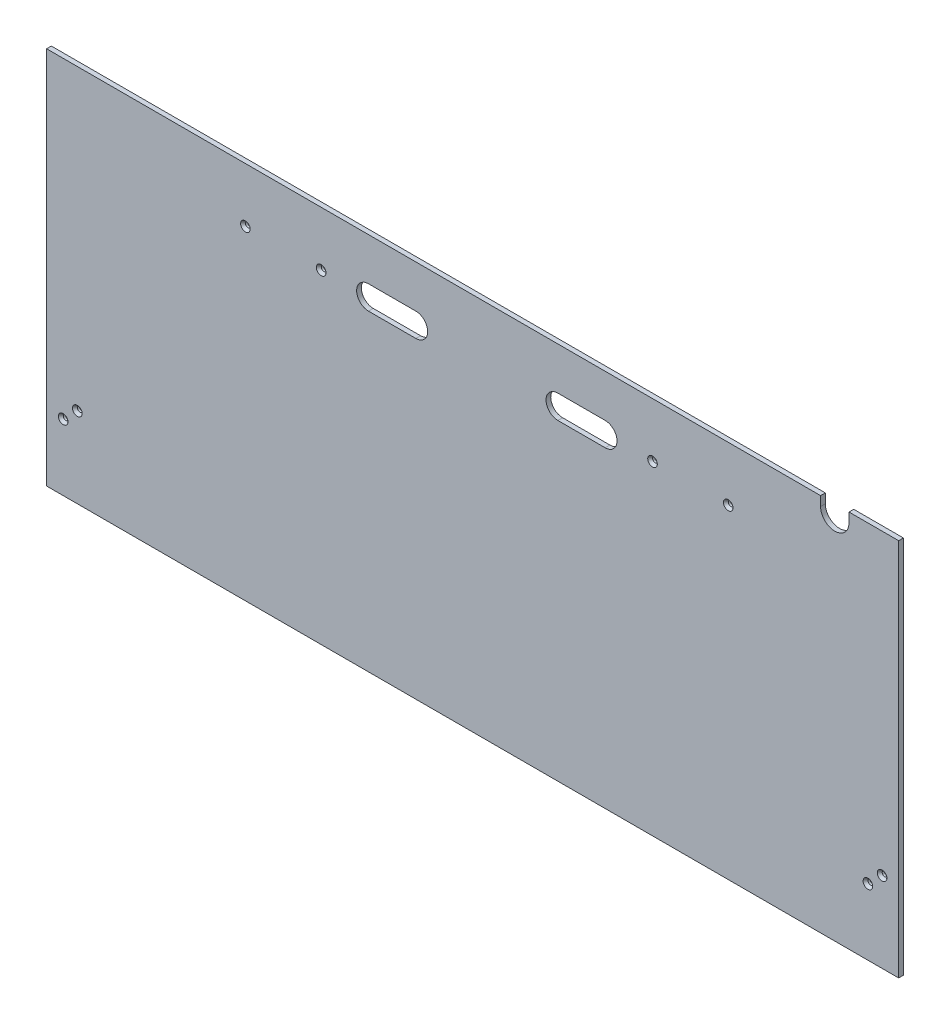
ISO-10303-21;
HEADER;
FILE_DESCRIPTION(('STEP AP214'),'2;1');
FILE_NAME('part.step','',(''),(''),'','','');
FILE_SCHEMA(('AUTOMOTIVE_DESIGN { 1 0 10303 214 1 1 1 1 }'));
ENDSEC;
DATA;
#1=APPLICATION_CONTEXT('core data for automotive mechanical design processes');
#2=APPLICATION_PROTOCOL_DEFINITION('international standard','automotive_design',2000,#1);
#3=PRODUCT_CONTEXT('',#1,'mechanical');
#4=PRODUCT('Part','Part','',(#3));
#5=PRODUCT_RELATED_PRODUCT_CATEGORY('part','',(#4));
#6=PRODUCT_DEFINITION_FORMATION('','',#4);
#7=PRODUCT_DEFINITION_CONTEXT('part definition',#1,'design');
#8=PRODUCT_DEFINITION('design','',#6,#7);
#9=PRODUCT_DEFINITION_SHAPE('','',#8);
#10=(LENGTH_UNIT() NAMED_UNIT(*) SI_UNIT(.MILLI.,.METRE.));
#11=(NAMED_UNIT(*) PLANE_ANGLE_UNIT() SI_UNIT($,.RADIAN.));
#12=(NAMED_UNIT(*) SI_UNIT($,.STERADIAN.) SOLID_ANGLE_UNIT());
#13=UNCERTAINTY_MEASURE_WITH_UNIT(LENGTH_MEASURE(1.E-05),#10,'distance_accuracy_value','');
#14=(GEOMETRIC_REPRESENTATION_CONTEXT(3) GLOBAL_UNCERTAINTY_ASSIGNED_CONTEXT((#13)) GLOBAL_UNIT_ASSIGNED_CONTEXT((#10,
#11,#12)) REPRESENTATION_CONTEXT('',''));
#15=CARTESIAN_POINT('',(0.,0.,0.));
#16=DIRECTION('',(0.,0.,1.));
#17=DIRECTION('',(1.,0.,0.));
#18=AXIS2_PLACEMENT_3D('',#15,#16,#17);
#19=CARTESIAN_POINT('',(0.,508.,6.35));
#20=DIRECTION('',(0.,-1.,0.));
#21=DIRECTION('',(0.,0.,-1.));
#22=AXIS2_PLACEMENT_3D('',#19,#20,#21);
#23=PLANE('',#22);
#24=DIRECTION('',(-1.,0.,0.));
#25=VECTOR('',#24,1.);
#26=CARTESIAN_POINT('',(0.,508.,6.35));
#27=LINE('',#26,#25);
#28=CARTESIAN_POINT('',(1038.225,508.,6.35));
#29=VERTEX_POINT('',#28);
#30=CARTESIAN_POINT('',(0.,508.,6.35));
#31=VERTEX_POINT('',#30);
#32=EDGE_CURVE('E324',#29,#31,#27,.T.);
#33=ORIENTED_EDGE('',*,*,#32,.F.);
#34=DIRECTION('',(0.,0.,1.));
#35=VECTOR('',#34,1.);
#36=CARTESIAN_POINT('',(1038.225,508.,0.));
#37=LINE('',#36,#35);
#38=CARTESIAN_POINT('',(1038.225,508.,0.));
#39=VERTEX_POINT('',#38);
#40=EDGE_CURVE('E175',#39,#29,#37,.T.);
#41=ORIENTED_EDGE('',*,*,#40,.F.);
#42=DIRECTION('',(-1.,0.,0.));
#43=VECTOR('',#42,1.);
#44=CARTESIAN_POINT('',(0.,508.,0.));
#45=LINE('',#44,#43);
#46=CARTESIAN_POINT('',(0.,508.,0.));
#47=VERTEX_POINT('',#46);
#48=EDGE_CURVE('E166',#39,#47,#45,.T.);
#49=ORIENTED_EDGE('',*,*,#48,.T.);
#50=DIRECTION('',(0.,0.,-1.));
#51=VECTOR('',#50,1.);
#52=CARTESIAN_POINT('',(0.,508.,6.35));
#53=LINE('',#52,#51);
#54=EDGE_CURVE('E328',#31,#47,#53,.T.);
#55=ORIENTED_EDGE('',*,*,#54,.F.);
#56=EDGE_LOOP('',(#33,#41,#49,#55));
#57=FACE_BOUND('',#56,.T.);
#58=ADVANCED_FACE('F32',(#57),#23,.F.);
#59=CARTESIAN_POINT('',(0.,0.,6.35));
#60=DIRECTION('',(0.,0.,-1.));
#61=DIRECTION('',(-1.,0.,0.));
#62=AXIS2_PLACEMENT_3D('',#59,#60,#61);
#63=PLANE('',#62);
#64=CARTESIAN_POINT('',(368.3,434.975,6.35));
#65=DIRECTION('',(0.,0.,1.));
#66=DIRECTION('',(1.,0.,0.));
#67=AXIS2_PLACEMENT_3D('',#64,#65,#66);
#68=CIRCLE('',#67,6.43890000000003);
#69=CARTESIAN_POINT('',(374.7389,434.975,6.35));
#70=VERTEX_POINT('',#69);
#71=EDGE_CURVE('E199',#70,#70,#68,.T.);
#72=ORIENTED_EDGE('',*,*,#71,.F.);
#73=EDGE_LOOP('',(#72));
#74=FACE_BOUND('',#73,.T.);
#75=DIRECTION('',(1.,0.,0.));
#76=VECTOR('',#75,1.);
#77=CARTESIAN_POINT('',(431.8,419.1,6.35));
#78=LINE('',#77,#76);
#79=CARTESIAN_POINT('',(431.8,419.1,6.35));
#80=VERTEX_POINT('',#79);
#81=CARTESIAN_POINT('',(495.3,419.1,6.35));
#82=VERTEX_POINT('',#81);
#83=EDGE_CURVE('E269',#80,#82,#78,.T.);
#84=ORIENTED_EDGE('',*,*,#83,.F.);
#85=CARTESIAN_POINT('',(431.8,434.975,6.35));
#86=DIRECTION('',(0.,0.,1.));
#87=DIRECTION('',(1.,0.,0.));
#88=AXIS2_PLACEMENT_3D('',#85,#86,#87);
#89=CIRCLE('',#88,15.875);
#90=CARTESIAN_POINT('',(431.8,450.85,6.35));
#91=VERTEX_POINT('',#90);
#92=EDGE_CURVE('E55',#91,#80,#89,.T.);
#93=ORIENTED_EDGE('',*,*,#92,.F.);
#94=DIRECTION('',(-1.,0.,0.));
#95=VECTOR('',#94,1.);
#96=CARTESIAN_POINT('',(431.8,450.85,6.35));
#97=LINE('',#96,#95);
#98=CARTESIAN_POINT('',(495.3,450.85,6.35));
#99=VERTEX_POINT('',#98);
#100=EDGE_CURVE('E258',#99,#91,#97,.T.);
#101=ORIENTED_EDGE('',*,*,#100,.F.);
#102=CARTESIAN_POINT('',(495.3,434.975,6.35));
#103=DIRECTION('',(0.,0.,1.));
#104=DIRECTION('',(1.,0.,0.));
#105=AXIS2_PLACEMENT_3D('',#102,#103,#104);
#106=CIRCLE('',#105,15.875);
#107=EDGE_CURVE('E273',#82,#99,#106,.T.);
#108=ORIENTED_EDGE('',*,*,#107,.F.);
#109=EDGE_LOOP('',(#84,#93,#101,#108));
#110=FACE_BOUND('',#109,.T.);
#111=DIRECTION('',(1.,0.,0.));
#112=VECTOR('',#111,1.);
#113=CARTESIAN_POINT('',(685.8,419.1,6.35));
#114=LINE('',#113,#112);
#115=CARTESIAN_POINT('',(685.8,419.1,6.35));
#116=VERTEX_POINT('',#115);
#117=CARTESIAN_POINT('',(749.3,419.1,6.35));
#118=VERTEX_POINT('',#117);
#119=EDGE_CURVE('E301',#116,#118,#114,.T.);
#120=ORIENTED_EDGE('',*,*,#119,.F.);
#121=CARTESIAN_POINT('',(685.8,434.975,6.35));
#122=DIRECTION('',(0.,0.,1.));
#123=DIRECTION('',(1.,0.,0.));
#124=AXIS2_PLACEMENT_3D('',#121,#122,#123);
#125=CIRCLE('',#124,15.875);
#126=CARTESIAN_POINT('',(685.8,450.85,6.35));
#127=VERTEX_POINT('',#126);
#128=EDGE_CURVE('E253',#127,#116,#125,.T.);
#129=ORIENTED_EDGE('',*,*,#128,.F.);
#130=DIRECTION('',(-1.,0.,0.));
#131=VECTOR('',#130,1.);
#132=CARTESIAN_POINT('',(685.8,450.85,6.35));
#133=LINE('',#132,#131);
#134=CARTESIAN_POINT('',(749.3,450.85,6.35));
#135=VERTEX_POINT('',#134);
#136=EDGE_CURVE('E290',#135,#127,#133,.T.);
#137=ORIENTED_EDGE('',*,*,#136,.F.);
#138=CARTESIAN_POINT('',(749.3,434.975,6.35));
#139=DIRECTION('',(0.,0.,1.));
#140=DIRECTION('',(1.,0.,0.));
#141=AXIS2_PLACEMENT_3D('',#138,#139,#140);
#142=CIRCLE('',#141,15.875);
#143=EDGE_CURVE('E304',#118,#135,#142,.T.);
#144=ORIENTED_EDGE('',*,*,#143,.F.);
#145=EDGE_LOOP('',(#120,#129,#137,#144));
#146=FACE_BOUND('',#145,.T.);
#147=CARTESIAN_POINT('',(1057.275,495.3,6.35));
#148=DIRECTION('',(0.,0.,1.));
#149=DIRECTION('',(-1.,0.,0.));
#150=AXIS2_PLACEMENT_3D('',#147,#148,#149);
#151=CIRCLE('',#150,19.05);
#152=CARTESIAN_POINT('',(1038.225,495.3,6.35));
#153=VERTEX_POINT('',#152);
#154=CARTESIAN_POINT('',(1076.325,495.3,6.35));
#155=VERTEX_POINT('',#154);
#156=EDGE_CURVE('E169',#153,#155,#151,.T.);
#157=ORIENTED_EDGE('',*,*,#156,.F.);
#158=DIRECTION('',(0.,-1.,0.));
#159=VECTOR('',#158,1.);
#160=CARTESIAN_POINT('',(1038.225,508.,6.35));
#161=LINE('',#160,#159);
#162=EDGE_CURVE('E151',#29,#153,#161,.T.);
#163=ORIENTED_EDGE('',*,*,#162,.F.);
#164=ORIENTED_EDGE('',*,*,#32,.T.);
#165=DIRECTION('',(0.,-1.,0.));
#166=VECTOR('',#165,1.);
#167=CARTESIAN_POINT('',(0.,0.,6.35));
#168=LINE('',#167,#166);
#169=CARTESIAN_POINT('',(0.,0.,6.35));
#170=VERTEX_POINT('',#169);
#171=EDGE_CURVE('E316',#31,#170,#168,.T.);
#172=ORIENTED_EDGE('',*,*,#171,.T.);
#173=DIRECTION('',(1.,0.,0.));
#174=VECTOR('',#173,1.);
#175=CARTESIAN_POINT('',(0.,0.,6.35));
#176=LINE('',#175,#174);
#177=CARTESIAN_POINT('',(1143.,0.,6.35));
#178=VERTEX_POINT('',#177);
#179=EDGE_CURVE('E319',#170,#178,#176,.T.);
#180=ORIENTED_EDGE('',*,*,#179,.T.);
#181=DIRECTION('',(0.,1.,0.));
#182=VECTOR('',#181,1.);
#183=CARTESIAN_POINT('',(1143.,0.,6.35));
#184=LINE('',#183,#182);
#185=CARTESIAN_POINT('',(1143.,508.,6.35));
#186=VERTEX_POINT('',#185);
#187=EDGE_CURVE('E322',#178,#186,#184,.T.);
#188=ORIENTED_EDGE('',*,*,#187,.T.);
#189=CARTESIAN_POINT('',(1076.325,508.,6.35));
#190=VERTEX_POINT('',#189);
#191=EDGE_CURVE('E325',#186,#190,#27,.T.);
#192=ORIENTED_EDGE('',*,*,#191,.T.);
#193=DIRECTION('',(0.,1.,0.));
#194=VECTOR('',#193,1.);
#195=CARTESIAN_POINT('',(1076.325,508.,6.35));
#196=LINE('',#195,#194);
#197=EDGE_CURVE('E167',#155,#190,#196,.T.);
#198=ORIENTED_EDGE('',*,*,#197,.F.);
#199=EDGE_LOOP('',(#157,#163,#164,#172,#180,#188,#192,#198));
#200=FACE_BOUND('',#199,.T.);
#201=CARTESIAN_POINT('',(22.2249999999999,88.9,6.35));
#202=DIRECTION('',(0.,0.,1.));
#203=DIRECTION('',(1.,0.,0.));
#204=AXIS2_PLACEMENT_3D('',#201,#202,#203);
#205=CIRCLE('',#204,6.4389);
#206=CARTESIAN_POINT('',(28.6638999999999,88.9,6.35));
#207=VERTEX_POINT('',#206);
#208=EDGE_CURVE('E244',#207,#207,#205,.T.);
#209=ORIENTED_EDGE('',*,*,#208,.F.);
#210=EDGE_LOOP('',(#209));
#211=FACE_BOUND('',#210,.T.);
#212=CARTESIAN_POINT('',(41.2749999999999,107.95,6.35));
#213=DIRECTION('',(0.,0.,1.));
#214=DIRECTION('',(1.,0.,0.));
#215=AXIS2_PLACEMENT_3D('',#212,#213,#214);
#216=CIRCLE('',#215,6.4389);
#217=CARTESIAN_POINT('',(47.7138999999999,107.95,6.35));
#218=VERTEX_POINT('',#217);
#219=EDGE_CURVE('E235',#218,#218,#216,.T.);
#220=ORIENTED_EDGE('',*,*,#219,.F.);
#221=EDGE_LOOP('',(#220));
#222=FACE_BOUND('',#221,.T.);
#223=CARTESIAN_POINT('',(1101.725,88.9,6.35));
#224=DIRECTION('',(0.,0.,1.));
#225=DIRECTION('',(1.,0.,0.));
#226=AXIS2_PLACEMENT_3D('',#223,#224,#225);
#227=CIRCLE('',#226,6.43890000000003);
#228=CARTESIAN_POINT('',(1108.1639,88.9,6.35));
#229=VERTEX_POINT('',#228);
#230=EDGE_CURVE('E226',#229,#229,#227,.T.);
#231=ORIENTED_EDGE('',*,*,#230,.F.);
#232=EDGE_LOOP('',(#231));
#233=FACE_BOUND('',#232,.T.);
#234=CARTESIAN_POINT('',(1120.775,107.95,6.35));
#235=DIRECTION('',(0.,0.,1.));
#236=DIRECTION('',(1.,0.,0.));
#237=AXIS2_PLACEMENT_3D('',#234,#235,#236);
#238=CIRCLE('',#237,6.43890000000003);
#239=CARTESIAN_POINT('',(1127.2139,107.95,6.35));
#240=VERTEX_POINT('',#239);
#241=EDGE_CURVE('E217',#240,#240,#238,.T.);
#242=ORIENTED_EDGE('',*,*,#241,.F.);
#243=EDGE_LOOP('',(#242));
#244=FACE_BOUND('',#243,.T.);
#245=CARTESIAN_POINT('',(266.7,434.975,6.35));
#246=DIRECTION('',(0.,0.,1.));
#247=DIRECTION('',(1.,0.,0.));
#248=AXIS2_PLACEMENT_3D('',#245,#246,#247);
#249=CIRCLE('',#248,6.43890000000003);
#250=CARTESIAN_POINT('',(273.1389,434.975,6.35));
#251=VERTEX_POINT('',#250);
#252=EDGE_CURVE('E208',#251,#251,#249,.T.);
#253=ORIENTED_EDGE('',*,*,#252,.F.);
#254=EDGE_LOOP('',(#253));
#255=FACE_BOUND('',#254,.T.);
#256=CARTESIAN_POINT('',(812.8,434.975,6.35));
#257=DIRECTION('',(0.,0.,1.));
#258=DIRECTION('',(1.,0.,0.));
#259=AXIS2_PLACEMENT_3D('',#256,#257,#258);
#260=CIRCLE('',#259,6.43890000000003);
#261=CARTESIAN_POINT('',(819.2389,434.975,6.35));
#262=VERTEX_POINT('',#261);
#263=EDGE_CURVE('E190',#262,#262,#260,.T.);
#264=ORIENTED_EDGE('',*,*,#263,.F.);
#265=EDGE_LOOP('',(#264));
#266=FACE_BOUND('',#265,.T.);
#267=CARTESIAN_POINT('',(914.4,434.975,6.35));
#268=DIRECTION('',(0.,0.,1.));
#269=DIRECTION('',(1.,0.,0.));
#270=AXIS2_PLACEMENT_3D('',#267,#268,#269);
#271=CIRCLE('',#270,6.43890000000003);
#272=CARTESIAN_POINT('',(920.8389,434.975,6.35));
#273=VERTEX_POINT('',#272);
#274=EDGE_CURVE('E177',#273,#273,#271,.T.);
#275=ORIENTED_EDGE('',*,*,#274,.F.);
#276=EDGE_LOOP('',(#275));
#277=FACE_BOUND('',#276,.T.);
#278=ADVANCED_FACE('F355',(#74,#110,#146,#200,#211,#222,#233,#244,#255,#266,#277),#63,.F.);
#279=CARTESIAN_POINT('',(0.,0.,6.35));
#280=DIRECTION('',(1.,0.,0.));
#281=DIRECTION('',(0.,0.,-1.));
#282=AXIS2_PLACEMENT_3D('',#279,#280,#281);
#283=PLANE('',#282);
#284=DIRECTION('',(0.,-1.,0.));
#285=VECTOR('',#284,1.);
#286=CARTESIAN_POINT('',(0.,0.,0.));
#287=LINE('',#286,#285);
#288=CARTESIAN_POINT('',(0.,0.,0.));
#289=VERTEX_POINT('',#288);
#290=EDGE_CURVE('E280',#47,#289,#287,.T.);
#291=ORIENTED_EDGE('',*,*,#290,.T.);
#292=DIRECTION('',(0.,0.,-1.));
#293=VECTOR('',#292,1.);
#294=CARTESIAN_POINT('',(0.,0.,6.35));
#295=LINE('',#294,#293);
#296=EDGE_CURVE('E11',#170,#289,#295,.T.);
#297=ORIENTED_EDGE('',*,*,#296,.F.);
#298=ORIENTED_EDGE('',*,*,#171,.F.);
#299=ORIENTED_EDGE('',*,*,#54,.T.);
#300=EDGE_LOOP('',(#291,#297,#298,#299));
#301=FACE_BOUND('',#300,.T.);
#302=ADVANCED_FACE('F34',(#301),#283,.F.);
#303=CARTESIAN_POINT('',(0.,0.,6.35));
#304=DIRECTION('',(0.,1.,0.));
#305=DIRECTION('',(0.,0.,1.));
#306=AXIS2_PLACEMENT_3D('',#303,#304,#305);
#307=PLANE('',#306);
#308=DIRECTION('',(1.,0.,0.));
#309=VECTOR('',#308,1.);
#310=CARTESIAN_POINT('',(0.,0.,0.));
#311=LINE('',#310,#309);
#312=CARTESIAN_POINT('',(1143.,0.,0.));
#313=VERTEX_POINT('',#312);
#314=EDGE_CURVE('E331',#289,#313,#311,.T.);
#315=ORIENTED_EDGE('',*,*,#314,.T.);
#316=DIRECTION('',(0.,0.,-1.));
#317=VECTOR('',#316,1.);
#318=CARTESIAN_POINT('',(1143.,0.,6.35));
#319=LINE('',#318,#317);
#320=EDGE_CURVE('E40',#178,#313,#319,.T.);
#321=ORIENTED_EDGE('',*,*,#320,.F.);
#322=ORIENTED_EDGE('',*,*,#179,.F.);
#323=ORIENTED_EDGE('',*,*,#296,.T.);
#324=EDGE_LOOP('',(#315,#321,#322,#323));
#325=FACE_BOUND('',#324,.T.);
#326=ADVANCED_FACE('F359',(#325),#307,.F.);
#327=CARTESIAN_POINT('',(1143.,0.,6.35));
#328=DIRECTION('',(-1.,0.,0.));
#329=DIRECTION('',(0.,0.,1.));
#330=AXIS2_PLACEMENT_3D('',#327,#328,#329);
#331=PLANE('',#330);
#332=DIRECTION('',(0.,1.,0.));
#333=VECTOR('',#332,1.);
#334=CARTESIAN_POINT('',(1143.,0.,0.));
#335=LINE('',#334,#333);
#336=CARTESIAN_POINT('',(1143.,508.,0.));
#337=VERTEX_POINT('',#336);
#338=EDGE_CURVE('E333',#313,#337,#335,.T.);
#339=ORIENTED_EDGE('',*,*,#338,.T.);
#340=DIRECTION('',(0.,0.,-1.));
#341=VECTOR('',#340,1.);
#342=CARTESIAN_POINT('',(1143.,508.,6.35));
#343=LINE('',#342,#341);
#344=EDGE_CURVE('E339',#186,#337,#343,.T.);
#345=ORIENTED_EDGE('',*,*,#344,.F.);
#346=ORIENTED_EDGE('',*,*,#187,.F.);
#347=ORIENTED_EDGE('',*,*,#320,.T.);
#348=EDGE_LOOP('',(#339,#345,#346,#347));
#349=FACE_BOUND('',#348,.T.);
#350=ADVANCED_FACE('F346',(#349),#331,.F.);
#351=CARTESIAN_POINT('',(1076.325,508.,0.));
#352=VERTEX_POINT('',#351);
#353=EDGE_CURVE('E320',#337,#352,#45,.T.);
#354=ORIENTED_EDGE('',*,*,#353,.T.);
#355=DIRECTION('',(0.,0.,1.));
#356=VECTOR('',#355,1.);
#357=CARTESIAN_POINT('',(1076.325,508.,0.));
#358=LINE('',#357,#356);
#359=EDGE_CURVE('E178',#352,#190,#358,.T.);
#360=ORIENTED_EDGE('',*,*,#359,.T.);
#361=ORIENTED_EDGE('',*,*,#191,.F.);
#362=ORIENTED_EDGE('',*,*,#344,.T.);
#363=EDGE_LOOP('',(#354,#360,#361,#362));
#364=FACE_BOUND('',#363,.T.);
#365=ADVANCED_FACE('F351',(#364),#23,.F.);
#366=CARTESIAN_POINT('',(0.,0.,0.));
#367=DIRECTION('',(0.,0.,-1.));
#368=DIRECTION('',(-1.,0.,0.));
#369=AXIS2_PLACEMENT_3D('',#366,#367,#368);
#370=PLANE('',#369);
#371=DIRECTION('',(0.,-1.,0.));
#372=VECTOR('',#371,1.);
#373=CARTESIAN_POINT('',(1038.225,508.,0.));
#374=LINE('',#373,#372);
#375=CARTESIAN_POINT('',(1038.225,495.3,0.));
#376=VERTEX_POINT('',#375);
#377=EDGE_CURVE('E148',#39,#376,#374,.T.);
#378=ORIENTED_EDGE('',*,*,#377,.T.);
#379=CARTESIAN_POINT('',(1057.275,495.3,0.));
#380=DIRECTION('',(0.,0.,1.));
#381=DIRECTION('',(-1.,0.,0.));
#382=AXIS2_PLACEMENT_3D('',#379,#380,#381);
#383=CIRCLE('',#382,19.05);
#384=CARTESIAN_POINT('',(1076.325,495.3,0.));
#385=VERTEX_POINT('',#384);
#386=EDGE_CURVE('E158',#376,#385,#383,.T.);
#387=ORIENTED_EDGE('',*,*,#386,.T.);
#388=DIRECTION('',(0.,1.,0.));
#389=VECTOR('',#388,1.);
#390=CARTESIAN_POINT('',(1076.325,508.,0.));
#391=LINE('',#390,#389);
#392=EDGE_CURVE('E47',#385,#352,#391,.T.);
#393=ORIENTED_EDGE('',*,*,#392,.T.);
#394=ORIENTED_EDGE('',*,*,#353,.F.);
#395=ORIENTED_EDGE('',*,*,#338,.F.);
#396=ORIENTED_EDGE('',*,*,#314,.F.);
#397=ORIENTED_EDGE('',*,*,#290,.F.);
#398=ORIENTED_EDGE('',*,*,#48,.F.);
#399=EDGE_LOOP('',(#378,#387,#393,#394,#395,#396,#397,#398));
#400=FACE_BOUND('',#399,.T.);
#401=CARTESIAN_POINT('',(914.4,434.975,0.));
#402=DIRECTION('',(0.,0.,-1.));
#403=DIRECTION('',(-1.,0.,0.));
#404=AXIS2_PLACEMENT_3D('',#401,#402,#403);
#405=CIRCLE('',#404,3.3782);
#406=CARTESIAN_POINT('',(911.0218,434.975,0.));
#407=VERTEX_POINT('',#406);
#408=EDGE_CURVE('E187',#407,#407,#405,.T.);
#409=ORIENTED_EDGE('',*,*,#408,.F.);
#410=EDGE_LOOP('',(#409));
#411=FACE_BOUND('',#410,.T.);
#412=CARTESIAN_POINT('',(812.8,434.975,0.));
#413=DIRECTION('',(0.,0.,-1.));
#414=DIRECTION('',(-1.,0.,0.));
#415=AXIS2_PLACEMENT_3D('',#412,#413,#414);
#416=CIRCLE('',#415,3.3782);
#417=CARTESIAN_POINT('',(809.4218,434.975,0.));
#418=VERTEX_POINT('',#417);
#419=EDGE_CURVE('E196',#418,#418,#416,.T.);
#420=ORIENTED_EDGE('',*,*,#419,.F.);
#421=EDGE_LOOP('',(#420));
#422=FACE_BOUND('',#421,.T.);
#423=CARTESIAN_POINT('',(368.3,434.975,0.));
#424=DIRECTION('',(0.,0.,-1.));
#425=DIRECTION('',(-1.,0.,0.));
#426=AXIS2_PLACEMENT_3D('',#423,#424,#425);
#427=CIRCLE('',#426,3.3782);
#428=CARTESIAN_POINT('',(364.9218,434.975,0.));
#429=VERTEX_POINT('',#428);
#430=EDGE_CURVE('E205',#429,#429,#427,.T.);
#431=ORIENTED_EDGE('',*,*,#430,.F.);
#432=EDGE_LOOP('',(#431));
#433=FACE_BOUND('',#432,.T.);
#434=CARTESIAN_POINT('',(266.7,434.975,0.));
#435=DIRECTION('',(0.,0.,-1.));
#436=DIRECTION('',(-1.,0.,0.));
#437=AXIS2_PLACEMENT_3D('',#434,#435,#436);
#438=CIRCLE('',#437,3.3782);
#439=CARTESIAN_POINT('',(263.3218,434.975,0.));
#440=VERTEX_POINT('',#439);
#441=EDGE_CURVE('E214',#440,#440,#438,.T.);
#442=ORIENTED_EDGE('',*,*,#441,.F.);
#443=EDGE_LOOP('',(#442));
#444=FACE_BOUND('',#443,.T.);
#445=CARTESIAN_POINT('',(1120.775,107.95,0.));
#446=DIRECTION('',(0.,0.,-1.));
#447=DIRECTION('',(-1.,0.,0.));
#448=AXIS2_PLACEMENT_3D('',#445,#446,#447);
#449=CIRCLE('',#448,3.3782);
#450=CARTESIAN_POINT('',(1117.3968,107.95,0.));
#451=VERTEX_POINT('',#450);
#452=EDGE_CURVE('E223',#451,#451,#449,.T.);
#453=ORIENTED_EDGE('',*,*,#452,.F.);
#454=EDGE_LOOP('',(#453));
#455=FACE_BOUND('',#454,.T.);
#456=CARTESIAN_POINT('',(1101.725,88.9,0.));
#457=DIRECTION('',(0.,0.,-1.));
#458=DIRECTION('',(-1.,0.,0.));
#459=AXIS2_PLACEMENT_3D('',#456,#457,#458);
#460=CIRCLE('',#459,3.3782);
#461=CARTESIAN_POINT('',(1098.3468,88.9,0.));
#462=VERTEX_POINT('',#461);
#463=EDGE_CURVE('E232',#462,#462,#460,.T.);
#464=ORIENTED_EDGE('',*,*,#463,.F.);
#465=EDGE_LOOP('',(#464));
#466=FACE_BOUND('',#465,.T.);
#467=CARTESIAN_POINT('',(41.2749999999999,107.95,0.));
#468=DIRECTION('',(0.,0.,-1.));
#469=DIRECTION('',(-1.,0.,0.));
#470=AXIS2_PLACEMENT_3D('',#467,#468,#469);
#471=CIRCLE('',#470,3.3782);
#472=CARTESIAN_POINT('',(37.8968,107.95,0.));
#473=VERTEX_POINT('',#472);
#474=EDGE_CURVE('E241',#473,#473,#471,.T.);
#475=ORIENTED_EDGE('',*,*,#474,.F.);
#476=EDGE_LOOP('',(#475));
#477=FACE_BOUND('',#476,.T.);
#478=CARTESIAN_POINT('',(22.2249999999999,88.9,0.));
#479=DIRECTION('',(0.,0.,-1.));
#480=DIRECTION('',(-1.,0.,0.));
#481=AXIS2_PLACEMENT_3D('',#478,#479,#480);
#482=CIRCLE('',#481,3.3782);
#483=CARTESIAN_POINT('',(18.8467999999999,88.9,0.));
#484=VERTEX_POINT('',#483);
#485=EDGE_CURVE('E250',#484,#484,#482,.T.);
#486=ORIENTED_EDGE('',*,*,#485,.F.);
#487=EDGE_LOOP('',(#486));
#488=FACE_BOUND('',#487,.T.);
#489=CARTESIAN_POINT('',(431.8,434.975,0.));
#490=DIRECTION('',(0.,0.,1.));
#491=DIRECTION('',(1.,0.,0.));
#492=AXIS2_PLACEMENT_3D('',#489,#490,#491);
#493=CIRCLE('',#492,15.875);
#494=CARTESIAN_POINT('',(431.8,450.85,0.));
#495=VERTEX_POINT('',#494);
#496=CARTESIAN_POINT('',(431.8,419.1,0.));
#497=VERTEX_POINT('',#496);
#498=EDGE_CURVE('E254',#495,#497,#493,.T.);
#499=ORIENTED_EDGE('',*,*,#498,.T.);
#500=DIRECTION('',(1.,0.,0.));
#501=VECTOR('',#500,1.);
#502=CARTESIAN_POINT('',(431.8,419.1,0.));
#503=LINE('',#502,#501);
#504=CARTESIAN_POINT('',(495.3,419.1,0.));
#505=VERTEX_POINT('',#504);
#506=EDGE_CURVE('E257',#497,#505,#503,.T.);
#507=ORIENTED_EDGE('',*,*,#506,.T.);
#508=CARTESIAN_POINT('',(495.3,434.975,0.));
#509=DIRECTION('',(0.,0.,1.));
#510=DIRECTION('',(1.,0.,0.));
#511=AXIS2_PLACEMENT_3D('',#508,#509,#510);
#512=CIRCLE('',#511,15.875);
#513=CARTESIAN_POINT('',(495.3,450.85,0.));
#514=VERTEX_POINT('',#513);
#515=EDGE_CURVE('E261',#505,#514,#512,.T.);
#516=ORIENTED_EDGE('',*,*,#515,.T.);
#517=DIRECTION('',(-1.,0.,0.));
#518=VECTOR('',#517,1.);
#519=CARTESIAN_POINT('',(431.8,450.85,0.));
#520=LINE('',#519,#518);
#521=EDGE_CURVE('E264',#514,#495,#520,.T.);
#522=ORIENTED_EDGE('',*,*,#521,.T.);
#523=EDGE_LOOP('',(#499,#507,#516,#522));
#524=FACE_BOUND('',#523,.T.);
#525=CARTESIAN_POINT('',(685.8,434.975,0.));
#526=DIRECTION('',(0.,0.,1.));
#527=DIRECTION('',(1.,0.,0.));
#528=AXIS2_PLACEMENT_3D('',#525,#526,#527);
#529=CIRCLE('',#528,15.875);
#530=CARTESIAN_POINT('',(685.8,450.85,0.));
#531=VERTEX_POINT('',#530);
#532=CARTESIAN_POINT('',(685.8,419.1,0.));
#533=VERTEX_POINT('',#532);
#534=EDGE_CURVE('E286',#531,#533,#529,.T.);
#535=ORIENTED_EDGE('',*,*,#534,.T.);
#536=DIRECTION('',(1.,0.,0.));
#537=VECTOR('',#536,1.);
#538=CARTESIAN_POINT('',(685.8,419.1,0.));
#539=LINE('',#538,#537);
#540=CARTESIAN_POINT('',(749.3,419.1,0.));
#541=VERTEX_POINT('',#540);
#542=EDGE_CURVE('E289',#533,#541,#539,.T.);
#543=ORIENTED_EDGE('',*,*,#542,.T.);
#544=CARTESIAN_POINT('',(749.3,434.975,0.));
#545=DIRECTION('',(0.,0.,1.));
#546=DIRECTION('',(1.,0.,0.));
#547=AXIS2_PLACEMENT_3D('',#544,#545,#546);
#548=CIRCLE('',#547,15.875);
#549=CARTESIAN_POINT('',(749.3,450.85,0.));
#550=VERTEX_POINT('',#549);
#551=EDGE_CURVE('E293',#541,#550,#548,.T.);
#552=ORIENTED_EDGE('',*,*,#551,.T.);
#553=DIRECTION('',(-1.,0.,0.));
#554=VECTOR('',#553,1.);
#555=CARTESIAN_POINT('',(685.8,450.85,0.));
#556=LINE('',#555,#554);
#557=EDGE_CURVE('E296',#550,#531,#556,.T.);
#558=ORIENTED_EDGE('',*,*,#557,.T.);
#559=EDGE_LOOP('',(#535,#543,#552,#558));
#560=FACE_BOUND('',#559,.T.);
#561=ADVANCED_FACE('F163',(#400,#411,#422,#433,#444,#455,#466,#477,#488,#524,#560),#370,.T.);
#562=CARTESIAN_POINT('',(685.8,434.975,0.));
#563=DIRECTION('',(0.,0.,1.));
#564=DIRECTION('',(1.,0.,0.));
#565=AXIS2_PLACEMENT_3D('',#562,#563,#564);
#566=CYLINDRICAL_SURFACE('',#565,15.875);
#567=ORIENTED_EDGE('',*,*,#128,.T.);
#568=DIRECTION('',(0.,0.,1.));
#569=VECTOR('',#568,1.);
#570=CARTESIAN_POINT('',(685.8,419.1,0.));
#571=LINE('',#570,#569);
#572=EDGE_CURVE('E299',#533,#116,#571,.T.);
#573=ORIENTED_EDGE('',*,*,#572,.F.);
#574=ORIENTED_EDGE('',*,*,#534,.F.);
#575=DIRECTION('',(0.,0.,1.));
#576=VECTOR('',#575,1.);
#577=CARTESIAN_POINT('',(685.8,450.85,0.));
#578=LINE('',#577,#576);
#579=EDGE_CURVE('E270',#531,#127,#578,.T.);
#580=ORIENTED_EDGE('',*,*,#579,.T.);
#581=EDGE_LOOP('',(#567,#573,#574,#580));
#582=FACE_BOUND('',#581,.T.);
#583=ADVANCED_FACE('F378',(#582),#566,.F.);
#584=CARTESIAN_POINT('',(685.8,450.85,0.));
#585=DIRECTION('',(0.,1.,0.));
#586=DIRECTION('',(0.,0.,1.));
#587=AXIS2_PLACEMENT_3D('',#584,#585,#586);
#588=PLANE('',#587);
#589=ORIENTED_EDGE('',*,*,#136,.T.);
#590=ORIENTED_EDGE('',*,*,#579,.F.);
#591=ORIENTED_EDGE('',*,*,#557,.F.);
#592=DIRECTION('',(0.,0.,1.));
#593=VECTOR('',#592,1.);
#594=CARTESIAN_POINT('',(749.3,450.85,0.));
#595=LINE('',#594,#593);
#596=EDGE_CURVE('E310',#550,#135,#595,.T.);
#597=ORIENTED_EDGE('',*,*,#596,.T.);
#598=EDGE_LOOP('',(#589,#590,#591,#597));
#599=FACE_BOUND('',#598,.T.);
#600=ADVANCED_FACE('F519',(#599),#588,.F.);
#601=CARTESIAN_POINT('',(749.3,434.975,0.));
#602=DIRECTION('',(0.,0.,1.));
#603=DIRECTION('',(1.,0.,0.));
#604=AXIS2_PLACEMENT_3D('',#601,#602,#603);
#605=CYLINDRICAL_SURFACE('',#604,15.875);
#606=ORIENTED_EDGE('',*,*,#143,.T.);
#607=ORIENTED_EDGE('',*,*,#596,.F.);
#608=ORIENTED_EDGE('',*,*,#551,.F.);
#609=DIRECTION('',(0.,0.,1.));
#610=VECTOR('',#609,1.);
#611=CARTESIAN_POINT('',(749.3,419.1,0.));
#612=LINE('',#611,#610);
#613=EDGE_CURVE('E312',#541,#118,#612,.T.);
#614=ORIENTED_EDGE('',*,*,#613,.T.);
#615=EDGE_LOOP('',(#606,#607,#608,#614));
#616=FACE_BOUND('',#615,.T.);
#617=ADVANCED_FACE('F522',(#616),#605,.F.);
#618=CARTESIAN_POINT('',(685.8,419.1,0.));
#619=DIRECTION('',(0.,-1.,0.));
#620=DIRECTION('',(0.,0.,-1.));
#621=AXIS2_PLACEMENT_3D('',#618,#619,#620);
#622=PLANE('',#621);
#623=ORIENTED_EDGE('',*,*,#119,.T.);
#624=ORIENTED_EDGE('',*,*,#613,.F.);
#625=ORIENTED_EDGE('',*,*,#542,.F.);
#626=ORIENTED_EDGE('',*,*,#572,.T.);
#627=EDGE_LOOP('',(#623,#624,#625,#626));
#628=FACE_BOUND('',#627,.T.);
#629=ADVANCED_FACE('F518',(#628),#622,.F.);
#630=CARTESIAN_POINT('',(431.8,434.975,0.));
#631=DIRECTION('',(0.,0.,1.));
#632=DIRECTION('',(1.,0.,0.));
#633=AXIS2_PLACEMENT_3D('',#630,#631,#632);
#634=CYLINDRICAL_SURFACE('',#633,15.875);
#635=ORIENTED_EDGE('',*,*,#92,.T.);
#636=DIRECTION('',(0.,0.,1.));
#637=VECTOR('',#636,1.);
#638=CARTESIAN_POINT('',(431.8,419.1,0.));
#639=LINE('',#638,#637);
#640=EDGE_CURVE('E267',#497,#80,#639,.T.);
#641=ORIENTED_EDGE('',*,*,#640,.F.);
#642=ORIENTED_EDGE('',*,*,#498,.F.);
#643=DIRECTION('',(0.,0.,1.));
#644=VECTOR('',#643,1.);
#645=CARTESIAN_POINT('',(431.8,450.85,0.));
#646=LINE('',#645,#644);
#647=EDGE_CURVE('E278',#495,#91,#646,.T.);
#648=ORIENTED_EDGE('',*,*,#647,.T.);
#649=EDGE_LOOP('',(#635,#641,#642,#648));
#650=FACE_BOUND('',#649,.T.);
#651=ADVANCED_FACE('F508',(#650),#634,.F.);
#652=CARTESIAN_POINT('',(431.8,450.85,0.));
#653=DIRECTION('',(0.,1.,0.));
#654=DIRECTION('',(0.,0.,1.));
#655=AXIS2_PLACEMENT_3D('',#652,#653,#654);
#656=PLANE('',#655);
#657=ORIENTED_EDGE('',*,*,#100,.T.);
#658=ORIENTED_EDGE('',*,*,#647,.F.);
#659=ORIENTED_EDGE('',*,*,#521,.F.);
#660=DIRECTION('',(0.,0.,1.));
#661=VECTOR('',#660,1.);
#662=CARTESIAN_POINT('',(495.3,450.85,0.));
#663=LINE('',#662,#661);
#664=EDGE_CURVE('E281',#514,#99,#663,.T.);
#665=ORIENTED_EDGE('',*,*,#664,.T.);
#666=EDGE_LOOP('',(#657,#658,#659,#665));
#667=FACE_BOUND('',#666,.T.);
#668=ADVANCED_FACE('F504',(#667),#656,.F.);
#669=CARTESIAN_POINT('',(495.3,434.975,0.));
#670=DIRECTION('',(0.,0.,1.));
#671=DIRECTION('',(1.,0.,0.));
#672=AXIS2_PLACEMENT_3D('',#669,#670,#671);
#673=CYLINDRICAL_SURFACE('',#672,15.875);
#674=ORIENTED_EDGE('',*,*,#107,.T.);
#675=ORIENTED_EDGE('',*,*,#664,.F.);
#676=ORIENTED_EDGE('',*,*,#515,.F.);
#677=DIRECTION('',(0.,0.,1.));
#678=VECTOR('',#677,1.);
#679=CARTESIAN_POINT('',(495.3,419.1,0.));
#680=LINE('',#679,#678);
#681=EDGE_CURVE('E283',#505,#82,#680,.T.);
#682=ORIENTED_EDGE('',*,*,#681,.T.);
#683=EDGE_LOOP('',(#674,#675,#676,#682));
#684=FACE_BOUND('',#683,.T.);
#685=ADVANCED_FACE('F507',(#684),#673,.F.);
#686=CARTESIAN_POINT('',(431.8,419.1,0.));
#687=DIRECTION('',(0.,-1.,0.));
#688=DIRECTION('',(0.,0.,-1.));
#689=AXIS2_PLACEMENT_3D('',#686,#687,#688);
#690=PLANE('',#689);
#691=ORIENTED_EDGE('',*,*,#83,.T.);
#692=ORIENTED_EDGE('',*,*,#681,.F.);
#693=ORIENTED_EDGE('',*,*,#506,.F.);
#694=ORIENTED_EDGE('',*,*,#640,.T.);
#695=EDGE_LOOP('',(#691,#692,#693,#694));
#696=FACE_BOUND('',#695,.T.);
#697=ADVANCED_FACE('F502',(#696),#690,.F.);
#698=CARTESIAN_POINT('',(22.2249999999999,88.9,6.35));
#699=DIRECTION('',(0.,0.,1.));
#700=DIRECTION('',(1.,0.,0.));
#701=AXIS2_PLACEMENT_3D('',#698,#699,#700);
#702=CYLINDRICAL_SURFACE('',#701,3.3782);
#703=CARTESIAN_POINT('',(22.2249999999999,88.9,2.82906741601866));
#704=DIRECTION('',(0.,0.,1.));
#705=DIRECTION('',(1.,0.,0.));
#706=AXIS2_PLACEMENT_3D('',#703,#704,#705);
#707=CIRCLE('',#706,3.3782);
#708=CARTESIAN_POINT('',(25.6031999999999,88.9,2.82906741601866));
#709=VERTEX_POINT('',#708);
#710=EDGE_CURVE('E247',#709,#709,#707,.T.);
#711=ORIENTED_EDGE('',*,*,#710,.T.);
#712=EDGE_LOOP('',(#711));
#713=FACE_BOUND('',#712,.T.);
#714=ORIENTED_EDGE('',*,*,#485,.T.);
#715=EDGE_LOOP('',(#714));
#716=FACE_BOUND('',#715,.T.);
#717=ADVANCED_FACE('F498',(#713,#716),#702,.F.);
#718=CARTESIAN_POINT('',(22.2249999999999,88.9,6.35));
#719=DIRECTION('',(0.,0.,1.));
#720=DIRECTION('',(1.,0.,0.));
#721=AXIS2_PLACEMENT_3D('',#718,#719,#720);
#722=CONICAL_SURFACE('',#721,6.4389,0.715584993317677);
#723=ORIENTED_EDGE('',*,*,#710,.F.);
#724=EDGE_LOOP('',(#723));
#725=FACE_BOUND('',#724,.T.);
#726=ORIENTED_EDGE('',*,*,#208,.T.);
#727=EDGE_LOOP('',(#726));
#728=FACE_BOUND('',#727,.T.);
#729=ADVANCED_FACE('F494',(#725,#728),#722,.F.);
#730=CARTESIAN_POINT('',(41.2749999999999,107.95,6.35));
#731=DIRECTION('',(0.,0.,1.));
#732=DIRECTION('',(1.,0.,0.));
#733=AXIS2_PLACEMENT_3D('',#730,#731,#732);
#734=CYLINDRICAL_SURFACE('',#733,3.3782);
#735=CARTESIAN_POINT('',(41.2749999999999,107.95,2.82906741601866));
#736=DIRECTION('',(0.,0.,1.));
#737=DIRECTION('',(1.,0.,0.));
#738=AXIS2_PLACEMENT_3D('',#735,#736,#737);
#739=CIRCLE('',#738,3.3782);
#740=CARTESIAN_POINT('',(44.6531999999999,107.95,2.82906741601866));
#741=VERTEX_POINT('',#740);
#742=EDGE_CURVE('E238',#741,#741,#739,.T.);
#743=ORIENTED_EDGE('',*,*,#742,.T.);
#744=EDGE_LOOP('',(#743));
#745=FACE_BOUND('',#744,.T.);
#746=ORIENTED_EDGE('',*,*,#474,.T.);
#747=EDGE_LOOP('',(#746));
#748=FACE_BOUND('',#747,.T.);
#749=ADVANCED_FACE('F490',(#745,#748),#734,.F.);
#750=CARTESIAN_POINT('',(41.2749999999999,107.95,6.35));
#751=DIRECTION('',(0.,0.,1.));
#752=DIRECTION('',(1.,0.,0.));
#753=AXIS2_PLACEMENT_3D('',#750,#751,#752);
#754=CONICAL_SURFACE('',#753,6.4389,0.715584993317676);
#755=ORIENTED_EDGE('',*,*,#742,.F.);
#756=EDGE_LOOP('',(#755));
#757=FACE_BOUND('',#756,.T.);
#758=ORIENTED_EDGE('',*,*,#219,.T.);
#759=EDGE_LOOP('',(#758));
#760=FACE_BOUND('',#759,.T.);
#761=ADVANCED_FACE('F486',(#757,#760),#754,.F.);
#762=CARTESIAN_POINT('',(1101.725,88.9,6.35));
#763=DIRECTION('',(0.,0.,1.));
#764=DIRECTION('',(1.,0.,0.));
#765=AXIS2_PLACEMENT_3D('',#762,#763,#764);
#766=CYLINDRICAL_SURFACE('',#765,3.3782);
#767=CARTESIAN_POINT('',(1101.725,88.9,2.82906741601866));
#768=DIRECTION('',(0.,0.,1.));
#769=DIRECTION('',(1.,0.,0.));
#770=AXIS2_PLACEMENT_3D('',#767,#768,#769);
#771=CIRCLE('',#770,3.3782);
#772=CARTESIAN_POINT('',(1105.1032,88.9,2.82906741601866));
#773=VERTEX_POINT('',#772);
#774=EDGE_CURVE('E229',#773,#773,#771,.T.);
#775=ORIENTED_EDGE('',*,*,#774,.T.);
#776=EDGE_LOOP('',(#775));
#777=FACE_BOUND('',#776,.T.);
#778=ORIENTED_EDGE('',*,*,#463,.T.);
#779=EDGE_LOOP('',(#778));
#780=FACE_BOUND('',#779,.T.);
#781=ADVANCED_FACE('F482',(#777,#780),#766,.F.);
#782=CARTESIAN_POINT('',(1101.725,88.9,6.35));
#783=DIRECTION('',(0.,0.,1.));
#784=DIRECTION('',(1.,0.,0.));
#785=AXIS2_PLACEMENT_3D('',#782,#783,#784);
#786=CONICAL_SURFACE('',#785,6.43890000000003,0.715584993317681);
#787=ORIENTED_EDGE('',*,*,#774,.F.);
#788=EDGE_LOOP('',(#787));
#789=FACE_BOUND('',#788,.T.);
#790=ORIENTED_EDGE('',*,*,#230,.T.);
#791=EDGE_LOOP('',(#790));
#792=FACE_BOUND('',#791,.T.);
#793=ADVANCED_FACE('F478',(#789,#792),#786,.F.);
#794=CARTESIAN_POINT('',(1120.775,107.95,6.35));
#795=DIRECTION('',(0.,0.,1.));
#796=DIRECTION('',(1.,0.,0.));
#797=AXIS2_PLACEMENT_3D('',#794,#795,#796);
#798=CYLINDRICAL_SURFACE('',#797,3.3782);
#799=CARTESIAN_POINT('',(1120.775,107.95,2.82906741601866));
#800=DIRECTION('',(0.,0.,1.));
#801=DIRECTION('',(1.,0.,0.));
#802=AXIS2_PLACEMENT_3D('',#799,#800,#801);
#803=CIRCLE('',#802,3.3782);
#804=CARTESIAN_POINT('',(1124.1532,107.95,2.82906741601866));
#805=VERTEX_POINT('',#804);
#806=EDGE_CURVE('E220',#805,#805,#803,.T.);
#807=ORIENTED_EDGE('',*,*,#806,.T.);
#808=EDGE_LOOP('',(#807));
#809=FACE_BOUND('',#808,.T.);
#810=ORIENTED_EDGE('',*,*,#452,.T.);
#811=EDGE_LOOP('',(#810));
#812=FACE_BOUND('',#811,.T.);
#813=ADVANCED_FACE('F474',(#809,#812),#798,.F.);
#814=CARTESIAN_POINT('',(1120.775,107.95,6.35));
#815=DIRECTION('',(0.,0.,1.));
#816=DIRECTION('',(1.,0.,0.));
#817=AXIS2_PLACEMENT_3D('',#814,#815,#816);
#818=CONICAL_SURFACE('',#817,6.43890000000003,0.715584993317681);
#819=ORIENTED_EDGE('',*,*,#806,.F.);
#820=EDGE_LOOP('',(#819));
#821=FACE_BOUND('',#820,.T.);
#822=ORIENTED_EDGE('',*,*,#241,.T.);
#823=EDGE_LOOP('',(#822));
#824=FACE_BOUND('',#823,.T.);
#825=ADVANCED_FACE('F470',(#821,#824),#818,.F.);
#826=CARTESIAN_POINT('',(266.7,434.975,6.35));
#827=DIRECTION('',(0.,0.,1.));
#828=DIRECTION('',(1.,0.,0.));
#829=AXIS2_PLACEMENT_3D('',#826,#827,#828);
#830=CYLINDRICAL_SURFACE('',#829,3.3782);
#831=CARTESIAN_POINT('',(266.7,434.975,2.82906741601866));
#832=DIRECTION('',(0.,0.,1.));
#833=DIRECTION('',(1.,0.,0.));
#834=AXIS2_PLACEMENT_3D('',#831,#832,#833);
#835=CIRCLE('',#834,3.3782);
#836=CARTESIAN_POINT('',(270.0782,434.975,2.82906741601866));
#837=VERTEX_POINT('',#836);
#838=EDGE_CURVE('E211',#837,#837,#835,.T.);
#839=ORIENTED_EDGE('',*,*,#838,.T.);
#840=EDGE_LOOP('',(#839));
#841=FACE_BOUND('',#840,.T.);
#842=ORIENTED_EDGE('',*,*,#441,.T.);
#843=EDGE_LOOP('',(#842));
#844=FACE_BOUND('',#843,.T.);
#845=ADVANCED_FACE('F466',(#841,#844),#830,.F.);
#846=CARTESIAN_POINT('',(266.7,434.975,6.35));
#847=DIRECTION('',(0.,0.,1.));
#848=DIRECTION('',(1.,0.,0.));
#849=AXIS2_PLACEMENT_3D('',#846,#847,#848);
#850=CONICAL_SURFACE('',#849,6.43890000000003,0.715584993317681);
#851=ORIENTED_EDGE('',*,*,#838,.F.);
#852=EDGE_LOOP('',(#851));
#853=FACE_BOUND('',#852,.T.);
#854=ORIENTED_EDGE('',*,*,#252,.T.);
#855=EDGE_LOOP('',(#854));
#856=FACE_BOUND('',#855,.T.);
#857=ADVANCED_FACE('F462',(#853,#856),#850,.F.);
#858=CARTESIAN_POINT('',(368.3,434.975,6.35));
#859=DIRECTION('',(0.,0.,1.));
#860=DIRECTION('',(1.,0.,0.));
#861=AXIS2_PLACEMENT_3D('',#858,#859,#860);
#862=CYLINDRICAL_SURFACE('',#861,3.3782);
#863=CARTESIAN_POINT('',(368.3,434.975,2.82906741601866));
#864=DIRECTION('',(0.,0.,1.));
#865=DIRECTION('',(1.,0.,0.));
#866=AXIS2_PLACEMENT_3D('',#863,#864,#865);
#867=CIRCLE('',#866,3.3782);
#868=CARTESIAN_POINT('',(371.6782,434.975,2.82906741601866));
#869=VERTEX_POINT('',#868);
#870=EDGE_CURVE('E202',#869,#869,#867,.T.);
#871=ORIENTED_EDGE('',*,*,#870,.T.);
#872=EDGE_LOOP('',(#871));
#873=FACE_BOUND('',#872,.T.);
#874=ORIENTED_EDGE('',*,*,#430,.T.);
#875=EDGE_LOOP('',(#874));
#876=FACE_BOUND('',#875,.T.);
#877=ADVANCED_FACE('F458',(#873,#876),#862,.F.);
#878=CARTESIAN_POINT('',(368.3,434.975,6.35));
#879=DIRECTION('',(0.,0.,1.));
#880=DIRECTION('',(1.,0.,0.));
#881=AXIS2_PLACEMENT_3D('',#878,#879,#880);
#882=CONICAL_SURFACE('',#881,6.43890000000003,0.715584993317681);
#883=ORIENTED_EDGE('',*,*,#870,.F.);
#884=EDGE_LOOP('',(#883));
#885=FACE_BOUND('',#884,.T.);
#886=ORIENTED_EDGE('',*,*,#71,.T.);
#887=EDGE_LOOP('',(#886));
#888=FACE_BOUND('',#887,.T.);
#889=ADVANCED_FACE('F454',(#885,#888),#882,.F.);
#890=CARTESIAN_POINT('',(812.8,434.975,6.35));
#891=DIRECTION('',(0.,0.,1.));
#892=DIRECTION('',(1.,0.,0.));
#893=AXIS2_PLACEMENT_3D('',#890,#891,#892);
#894=CYLINDRICAL_SURFACE('',#893,3.3782);
#895=CARTESIAN_POINT('',(812.8,434.975,2.82906741601866));
#896=DIRECTION('',(0.,0.,1.));
#897=DIRECTION('',(1.,0.,0.));
#898=AXIS2_PLACEMENT_3D('',#895,#896,#897);
#899=CIRCLE('',#898,3.3782);
#900=CARTESIAN_POINT('',(816.1782,434.975,2.82906741601866));
#901=VERTEX_POINT('',#900);
#902=EDGE_CURVE('E193',#901,#901,#899,.T.);
#903=ORIENTED_EDGE('',*,*,#902,.T.);
#904=EDGE_LOOP('',(#903));
#905=FACE_BOUND('',#904,.T.);
#906=ORIENTED_EDGE('',*,*,#419,.T.);
#907=EDGE_LOOP('',(#906));
#908=FACE_BOUND('',#907,.T.);
#909=ADVANCED_FACE('F450',(#905,#908),#894,.F.);
#910=CARTESIAN_POINT('',(812.8,434.975,6.35));
#911=DIRECTION('',(0.,0.,1.));
#912=DIRECTION('',(1.,0.,0.));
#913=AXIS2_PLACEMENT_3D('',#910,#911,#912);
#914=CONICAL_SURFACE('',#913,6.43890000000003,0.715584993317681);
#915=ORIENTED_EDGE('',*,*,#902,.F.);
#916=EDGE_LOOP('',(#915));
#917=FACE_BOUND('',#916,.T.);
#918=ORIENTED_EDGE('',*,*,#263,.T.);
#919=EDGE_LOOP('',(#918));
#920=FACE_BOUND('',#919,.T.);
#921=ADVANCED_FACE('F446',(#917,#920),#914,.F.);
#922=CARTESIAN_POINT('',(914.4,434.975,6.35));
#923=DIRECTION('',(0.,0.,1.));
#924=DIRECTION('',(1.,0.,0.));
#925=AXIS2_PLACEMENT_3D('',#922,#923,#924);
#926=CYLINDRICAL_SURFACE('',#925,3.3782);
#927=CARTESIAN_POINT('',(914.4,434.975,2.82906741601866));
#928=DIRECTION('',(0.,0.,1.));
#929=DIRECTION('',(1.,0.,0.));
#930=AXIS2_PLACEMENT_3D('',#927,#928,#929);
#931=CIRCLE('',#930,3.3782);
#932=CARTESIAN_POINT('',(917.7782,434.975,2.82906741601866));
#933=VERTEX_POINT('',#932);
#934=EDGE_CURVE('E184',#933,#933,#931,.T.);
#935=ORIENTED_EDGE('',*,*,#934,.T.);
#936=EDGE_LOOP('',(#935));
#937=FACE_BOUND('',#936,.T.);
#938=ORIENTED_EDGE('',*,*,#408,.T.);
#939=EDGE_LOOP('',(#938));
#940=FACE_BOUND('',#939,.T.);
#941=ADVANCED_FACE('F442',(#937,#940),#926,.F.);
#942=CARTESIAN_POINT('',(914.4,434.975,6.35));
#943=DIRECTION('',(0.,0.,1.));
#944=DIRECTION('',(1.,0.,0.));
#945=AXIS2_PLACEMENT_3D('',#942,#943,#944);
#946=CONICAL_SURFACE('',#945,6.43890000000003,0.715584993317681);
#947=ORIENTED_EDGE('',*,*,#934,.F.);
#948=EDGE_LOOP('',(#947));
#949=FACE_BOUND('',#948,.T.);
#950=ORIENTED_EDGE('',*,*,#274,.T.);
#951=EDGE_LOOP('',(#950));
#952=FACE_BOUND('',#951,.T.);
#953=ADVANCED_FACE('F419',(#949,#952),#946,.F.);
#954=CARTESIAN_POINT('',(1038.225,508.,0.));
#955=DIRECTION('',(-1.,0.,0.));
#956=DIRECTION('',(0.,0.,1.));
#957=AXIS2_PLACEMENT_3D('',#954,#955,#956);
#958=PLANE('',#957);
#959=ORIENTED_EDGE('',*,*,#162,.T.);
#960=DIRECTION('',(0.,0.,1.));
#961=VECTOR('',#960,1.);
#962=CARTESIAN_POINT('',(1038.225,495.3,0.));
#963=LINE('',#962,#961);
#964=EDGE_CURVE('E144',#376,#153,#963,.T.);
#965=ORIENTED_EDGE('',*,*,#964,.F.);
#966=ORIENTED_EDGE('',*,*,#377,.F.);
#967=ORIENTED_EDGE('',*,*,#40,.T.);
#968=EDGE_LOOP('',(#959,#965,#966,#967));
#969=FACE_BOUND('',#968,.T.);
#970=ADVANCED_FACE('F146',(#969),#958,.F.);
#971=CARTESIAN_POINT('',(1076.325,508.,0.));
#972=DIRECTION('',(1.,0.,0.));
#973=DIRECTION('',(0.,0.,-1.));
#974=AXIS2_PLACEMENT_3D('',#971,#972,#973);
#975=PLANE('',#974);
#976=ORIENTED_EDGE('',*,*,#197,.T.);
#977=ORIENTED_EDGE('',*,*,#359,.F.);
#978=ORIENTED_EDGE('',*,*,#392,.F.);
#979=DIRECTION('',(0.,0.,1.));
#980=VECTOR('',#979,1.);
#981=CARTESIAN_POINT('',(1076.325,495.3,0.));
#982=LINE('',#981,#980);
#983=EDGE_CURVE('E155',#385,#155,#982,.T.);
#984=ORIENTED_EDGE('',*,*,#983,.T.);
#985=EDGE_LOOP('',(#976,#977,#978,#984));
#986=FACE_BOUND('',#985,.T.);
#987=ADVANCED_FACE('F418',(#986),#975,.F.);
#988=CARTESIAN_POINT('',(1057.275,495.3,0.));
#989=DIRECTION('',(0.,0.,1.));
#990=DIRECTION('',(1.,0.,0.));
#991=AXIS2_PLACEMENT_3D('',#988,#989,#990);
#992=CYLINDRICAL_SURFACE('',#991,19.05);
#993=ORIENTED_EDGE('',*,*,#156,.T.);
#994=ORIENTED_EDGE('',*,*,#983,.F.);
#995=ORIENTED_EDGE('',*,*,#386,.F.);
#996=ORIENTED_EDGE('',*,*,#964,.T.);
#997=EDGE_LOOP('',(#993,#994,#995,#996));
#998=FACE_BOUND('',#997,.T.);
#999=ADVANCED_FACE('F159',(#998),#992,.F.);
#1000=CLOSED_SHELL('',(#58,#278,#302,#326,#350,#365,#561,#583,#600,#617,#629,#651,#668,#685,
#697,#717,#729,#749,#761,#781,#793,#813,#825,#845,#857,#877,#889,#909,#921,#941,#953,#970,#987,#999));
#1001=MANIFOLD_SOLID_BREP('B2',#1000);
#1002=ADVANCED_BREP_SHAPE_REPRESENTATION('',(#18,#1001),#14);
#1003=SHAPE_DEFINITION_REPRESENTATION(#9,#1002);
ENDSEC;
END-ISO-10303-21;
